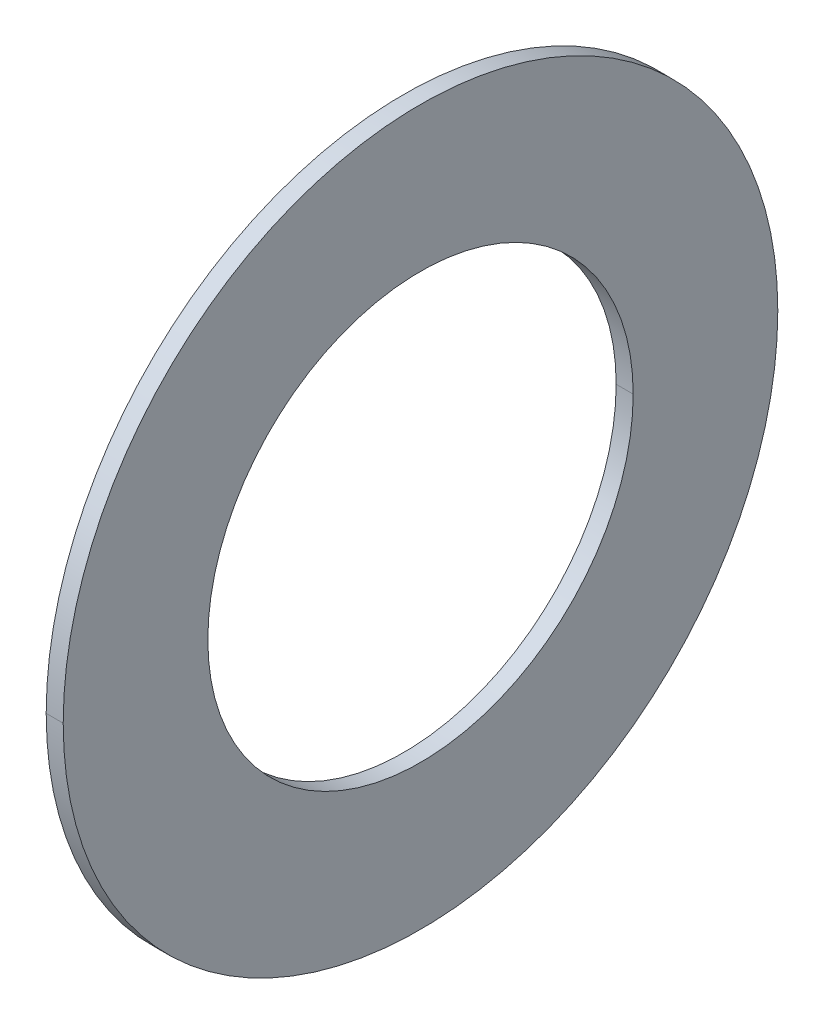
ISO-10303-21;
HEADER;
FILE_DESCRIPTION(('STEP AP214'),'2;1');
FILE_NAME('part.step','',(''),(''),'','','');
FILE_SCHEMA(('AUTOMOTIVE_DESIGN { 1 0 10303 214 1 1 1 1 }'));
ENDSEC;
DATA;
#1=APPLICATION_CONTEXT('core data for automotive mechanical design processes');
#2=APPLICATION_PROTOCOL_DEFINITION('international standard','automotive_design',2000,#1);
#3=PRODUCT_CONTEXT('',#1,'mechanical');
#4=PRODUCT('Part','Part','',(#3));
#5=PRODUCT_RELATED_PRODUCT_CATEGORY('part','',(#4));
#6=PRODUCT_DEFINITION_FORMATION('','',#4);
#7=PRODUCT_DEFINITION_CONTEXT('part definition',#1,'design');
#8=PRODUCT_DEFINITION('design','',#6,#7);
#9=PRODUCT_DEFINITION_SHAPE('','',#8);
#10=(LENGTH_UNIT() NAMED_UNIT(*) SI_UNIT(.MILLI.,.METRE.));
#11=(NAMED_UNIT(*) PLANE_ANGLE_UNIT() SI_UNIT($,.RADIAN.));
#12=(NAMED_UNIT(*) SI_UNIT($,.STERADIAN.) SOLID_ANGLE_UNIT());
#13=UNCERTAINTY_MEASURE_WITH_UNIT(LENGTH_MEASURE(1.E-05),#10,'distance_accuracy_value','');
#14=(GEOMETRIC_REPRESENTATION_CONTEXT(3) GLOBAL_UNCERTAINTY_ASSIGNED_CONTEXT((#13)) GLOBAL_UNIT_ASSIGNED_CONTEXT((#10,
#11,#12)) REPRESENTATION_CONTEXT('',''));
#15=CARTESIAN_POINT('',(0.,0.,0.));
#16=DIRECTION('',(0.,0.,1.));
#17=DIRECTION('',(1.,0.,0.));
#18=AXIS2_PLACEMENT_3D('',#15,#16,#17);
#19=CARTESIAN_POINT('',(-2.,21.,0.));
#20=DIRECTION('',(-1.,0.,0.));
#21=DIRECTION('',(0.,0.,1.));
#22=AXIS2_PLACEMENT_3D('',#19,#20,#21);
#23=PLANE('',#22);
#24=CARTESIAN_POINT('',(-2.,0.,0.));
#25=DIRECTION('',(1.,0.,0.));
#26=DIRECTION('',(0.,0.,-1.));
#27=AXIS2_PLACEMENT_3D('',#24,#25,#26);
#28=CIRCLE('',#27,12.5);
#29=CARTESIAN_POINT('',(-2.,0.,-12.5));
#30=VERTEX_POINT('',#29);
#31=CARTESIAN_POINT('',(-2.,0.,12.5));
#32=VERTEX_POINT('',#31);
#33=EDGE_CURVE('E11',#30,#32,#28,.T.);
#34=ORIENTED_EDGE('',*,*,#33,.T.);
#35=CARTESIAN_POINT('',(-2.,0.,0.));
#36=DIRECTION('',(1.,0.,0.));
#37=DIRECTION('',(0.,0.,-1.));
#38=AXIS2_PLACEMENT_3D('',#35,#36,#37);
#39=CIRCLE('',#38,12.5);
#40=EDGE_CURVE('E25',#32,#30,#39,.T.);
#41=ORIENTED_EDGE('',*,*,#40,.T.);
#42=EDGE_LOOP('',(#34,#41));
#43=FACE_BOUND('',#42,.T.);
#44=CARTESIAN_POINT('',(-2.,0.,0.));
#45=DIRECTION('',(1.,0.,0.));
#46=DIRECTION('',(0.,0.,-1.));
#47=AXIS2_PLACEMENT_3D('',#44,#45,#46);
#48=CIRCLE('',#47,21.);
#49=CARTESIAN_POINT('',(-2.,0.,21.));
#50=VERTEX_POINT('',#49);
#51=CARTESIAN_POINT('',(-2.,0.,-21.));
#52=VERTEX_POINT('',#51);
#53=EDGE_CURVE('E95',#50,#52,#48,.T.);
#54=ORIENTED_EDGE('',*,*,#53,.F.);
#55=CARTESIAN_POINT('',(-2.,0.,0.));
#56=DIRECTION('',(1.,0.,0.));
#57=DIRECTION('',(0.,0.,-1.));
#58=AXIS2_PLACEMENT_3D('',#55,#56,#57);
#59=CIRCLE('',#58,21.);
#60=EDGE_CURVE('E90',#52,#50,#59,.T.);
#61=ORIENTED_EDGE('',*,*,#60,.F.);
#62=EDGE_LOOP('',(#54,#61));
#63=FACE_BOUND('',#62,.T.);
#64=ADVANCED_FACE('F17',(#43,#63),#23,.T.);
#65=CARTESIAN_POINT('',(50.,0.,0.));
#66=DIRECTION('',(1.,0.,0.));
#67=DIRECTION('',(0.,-1.,0.));
#68=AXIS2_PLACEMENT_3D('',#65,#66,#67);
#69=CYLINDRICAL_SURFACE('',#68,21.);
#70=DIRECTION('',(1.,0.,0.));
#71=VECTOR('',#70,1.);
#72=CARTESIAN_POINT('',(-2.,0.,21.));
#73=LINE('',#72,#71);
#74=CARTESIAN_POINT('',(-1.,0.,21.));
#75=VERTEX_POINT('',#74);
#76=EDGE_CURVE('E86',#50,#75,#73,.T.);
#77=ORIENTED_EDGE('',*,*,#76,.T.);
#78=CARTESIAN_POINT('',(-1.,0.,0.));
#79=DIRECTION('',(1.,0.,0.));
#80=DIRECTION('',(0.,0.,-1.));
#81=AXIS2_PLACEMENT_3D('',#78,#79,#80);
#82=CIRCLE('',#81,21.);
#83=CARTESIAN_POINT('',(-1.,0.,-21.));
#84=VERTEX_POINT('',#83);
#85=EDGE_CURVE('E81',#84,#75,#82,.T.);
#86=ORIENTED_EDGE('',*,*,#85,.F.);
#87=DIRECTION('',(1.,0.,0.));
#88=VECTOR('',#87,1.);
#89=CARTESIAN_POINT('',(-2.,0.,-21.));
#90=LINE('',#89,#88);
#91=EDGE_CURVE('E70',#52,#84,#90,.T.);
#92=ORIENTED_EDGE('',*,*,#91,.F.);
#93=ORIENTED_EDGE('',*,*,#60,.T.);
#94=EDGE_LOOP('',(#77,#86,#92,#93));
#95=FACE_BOUND('',#94,.T.);
#96=ADVANCED_FACE('F111',(#95),#69,.T.);
#97=CARTESIAN_POINT('',(50.,0.,0.));
#98=DIRECTION('',(1.,0.,0.));
#99=DIRECTION('',(0.,1.,0.));
#100=AXIS2_PLACEMENT_3D('',#97,#98,#99);
#101=CYLINDRICAL_SURFACE('',#100,21.);
#102=ORIENTED_EDGE('',*,*,#76,.F.);
#103=ORIENTED_EDGE('',*,*,#53,.T.);
#104=ORIENTED_EDGE('',*,*,#91,.T.);
#105=CARTESIAN_POINT('',(-1.,0.,0.));
#106=DIRECTION('',(1.,0.,0.));
#107=DIRECTION('',(0.,0.,-1.));
#108=AXIS2_PLACEMENT_3D('',#105,#106,#107);
#109=CIRCLE('',#108,21.);
#110=EDGE_CURVE('E67',#75,#84,#109,.T.);
#111=ORIENTED_EDGE('',*,*,#110,.F.);
#112=EDGE_LOOP('',(#102,#103,#104,#111));
#113=FACE_BOUND('',#112,.T.);
#114=ADVANCED_FACE('F106',(#113),#101,.T.);
#115=CARTESIAN_POINT('',(-1.,12.5,0.));
#116=DIRECTION('',(1.,0.,0.));
#117=DIRECTION('',(0.,0.,-1.));
#118=AXIS2_PLACEMENT_3D('',#115,#116,#117);
#119=PLANE('',#118);
#120=ORIENTED_EDGE('',*,*,#85,.T.);
#121=ORIENTED_EDGE('',*,*,#110,.T.);
#122=EDGE_LOOP('',(#120,#121));
#123=FACE_BOUND('',#122,.T.);
#124=CARTESIAN_POINT('',(-1.,0.,0.));
#125=DIRECTION('',(1.,0.,0.));
#126=DIRECTION('',(0.,0.,-1.));
#127=AXIS2_PLACEMENT_3D('',#124,#125,#126);
#128=CIRCLE('',#127,12.5);
#129=CARTESIAN_POINT('',(-1.,0.,12.5));
#130=VERTEX_POINT('',#129);
#131=CARTESIAN_POINT('',(-1.,0.,-12.5));
#132=VERTEX_POINT('',#131);
#133=EDGE_CURVE('E55',#130,#132,#128,.T.);
#134=ORIENTED_EDGE('',*,*,#133,.F.);
#135=CARTESIAN_POINT('',(-1.,0.,0.));
#136=DIRECTION('',(1.,0.,0.));
#137=DIRECTION('',(0.,0.,-1.));
#138=AXIS2_PLACEMENT_3D('',#135,#136,#137);
#139=CIRCLE('',#138,12.5);
#140=EDGE_CURVE('E51',#132,#130,#139,.T.);
#141=ORIENTED_EDGE('',*,*,#140,.F.);
#142=EDGE_LOOP('',(#134,#141));
#143=FACE_BOUND('',#142,.T.);
#144=ADVANCED_FACE('F53',(#123,#143),#119,.T.);
#145=CARTESIAN_POINT('',(50.,0.,0.));
#146=DIRECTION('',(1.,0.,0.));
#147=DIRECTION('',(0.,-1.,0.));
#148=AXIS2_PLACEMENT_3D('',#145,#146,#147);
#149=CYLINDRICAL_SURFACE('',#148,12.5);
#150=DIRECTION('',(1.,0.,0.));
#151=VECTOR('',#150,1.);
#152=CARTESIAN_POINT('',(-2.,0.,12.5));
#153=LINE('',#152,#151);
#154=EDGE_CURVE('E59',#32,#130,#153,.T.);
#155=ORIENTED_EDGE('',*,*,#154,.F.);
#156=ORIENTED_EDGE('',*,*,#33,.F.);
#157=DIRECTION('',(1.,0.,0.));
#158=VECTOR('',#157,1.);
#159=CARTESIAN_POINT('',(-2.,0.,-12.5));
#160=LINE('',#159,#158);
#161=EDGE_CURVE('E62',#30,#132,#160,.T.);
#162=ORIENTED_EDGE('',*,*,#161,.T.);
#163=ORIENTED_EDGE('',*,*,#140,.T.);
#164=EDGE_LOOP('',(#155,#156,#162,#163));
#165=FACE_BOUND('',#164,.T.);
#166=ADVANCED_FACE('F63',(#165),#149,.F.);
#167=CARTESIAN_POINT('',(50.,0.,0.));
#168=DIRECTION('',(1.,0.,0.));
#169=DIRECTION('',(0.,1.,0.));
#170=AXIS2_PLACEMENT_3D('',#167,#168,#169);
#171=CYLINDRICAL_SURFACE('',#170,12.5);
#172=ORIENTED_EDGE('',*,*,#154,.T.);
#173=ORIENTED_EDGE('',*,*,#133,.T.);
#174=ORIENTED_EDGE('',*,*,#161,.F.);
#175=ORIENTED_EDGE('',*,*,#40,.F.);
#176=EDGE_LOOP('',(#172,#173,#174,#175));
#177=FACE_BOUND('',#176,.T.);
#178=ADVANCED_FACE('F66',(#177),#171,.F.);
#179=CLOSED_SHELL('',(#64,#96,#114,#144,#166,#178));
#180=MANIFOLD_SOLID_BREP('B1',#179);
#181=ADVANCED_BREP_SHAPE_REPRESENTATION('',(#18,#180),#14);
#182=SHAPE_DEFINITION_REPRESENTATION(#9,#181);
ENDSEC;
END-ISO-10303-21;
